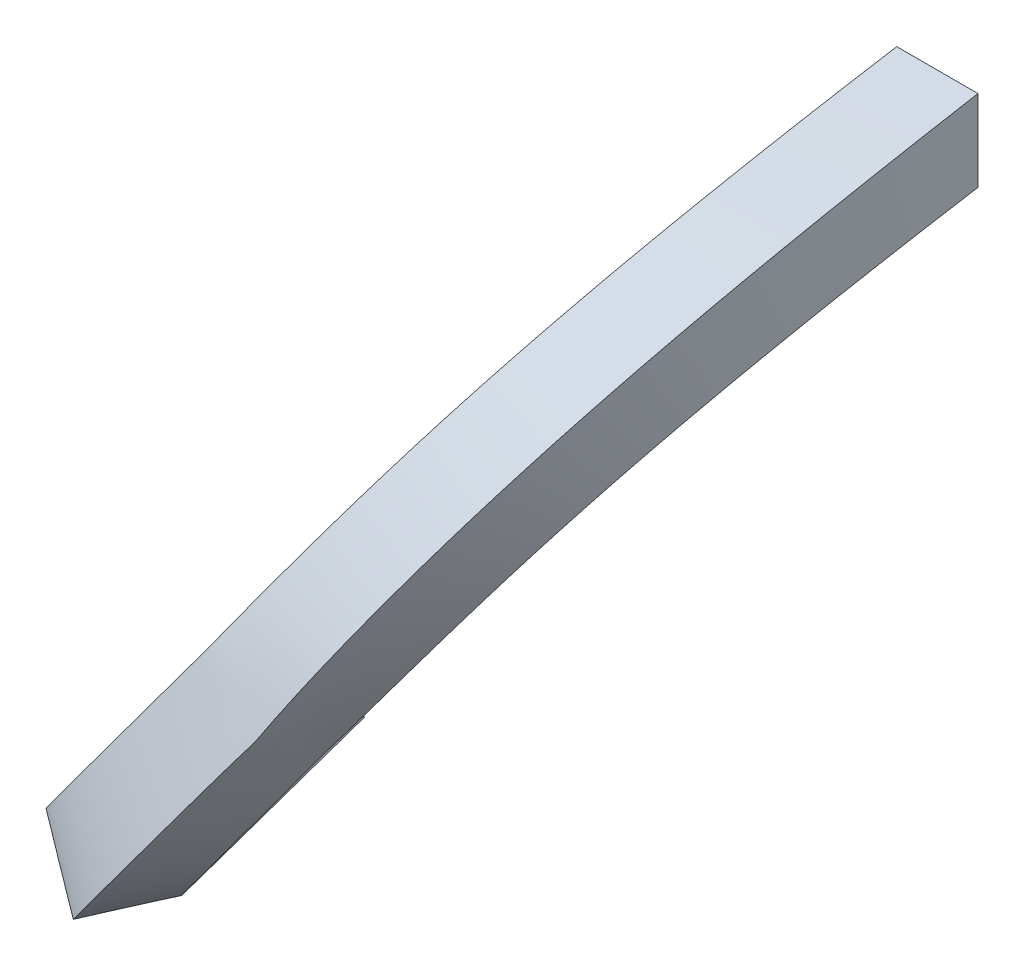
ISO-10303-21;
HEADER;
FILE_DESCRIPTION(('STEP AP214'),'2;1');
FILE_NAME('part.step','',(''),(''),'','','');
FILE_SCHEMA(('AUTOMOTIVE_DESIGN { 1 0 10303 214 1 1 1 1 }'));
ENDSEC;
DATA;
#1=APPLICATION_CONTEXT('core data for automotive mechanical design processes');
#2=APPLICATION_PROTOCOL_DEFINITION('international standard','automotive_design',2000,#1);
#3=PRODUCT_CONTEXT('',#1,'mechanical');
#4=PRODUCT('Part','Part','',(#3));
#5=PRODUCT_RELATED_PRODUCT_CATEGORY('part','',(#4));
#6=PRODUCT_DEFINITION_FORMATION('','',#4);
#7=PRODUCT_DEFINITION_CONTEXT('part definition',#1,'design');
#8=PRODUCT_DEFINITION('design','',#6,#7);
#9=PRODUCT_DEFINITION_SHAPE('','',#8);
#10=(LENGTH_UNIT() NAMED_UNIT(*) SI_UNIT(.MILLI.,.METRE.));
#11=(NAMED_UNIT(*) PLANE_ANGLE_UNIT() SI_UNIT($,.RADIAN.));
#12=(NAMED_UNIT(*) SI_UNIT($,.STERADIAN.) SOLID_ANGLE_UNIT());
#13=UNCERTAINTY_MEASURE_WITH_UNIT(LENGTH_MEASURE(1.E-05),#10,'distance_accuracy_value','');
#14=(GEOMETRIC_REPRESENTATION_CONTEXT(3) GLOBAL_UNCERTAINTY_ASSIGNED_CONTEXT((#13)) GLOBAL_UNIT_ASSIGNED_CONTEXT((#10,
#11,#12)) REPRESENTATION_CONTEXT('',''));
#15=CARTESIAN_POINT('',(0.,0.,0.));
#16=DIRECTION('',(0.,0.,1.));
#17=DIRECTION('',(1.,0.,0.));
#18=AXIS2_PLACEMENT_3D('',#15,#16,#17);
#19=CARTESIAN_POINT('',(-3.05311331771918E-13,-48.9988647583122,65.));
#20=DIRECTION('',(0.,0.,1.));
#21=DIRECTION('',(1.,0.,0.));
#22=AXIS2_PLACEMENT_3D('',#19,#20,#21);
#23=PLANE('',#22);
#24=DIRECTION('',(0.,-1.,0.));
#25=VECTOR('',#24,1.);
#26=CARTESIAN_POINT('',(6.,9.,65.));
#27=LINE('',#26,#25);
#28=CARTESIAN_POINT('',(6.,9.,65.));
#29=VERTEX_POINT('',#28);
#30=CARTESIAN_POINT('',(6.,3.,65.));
#31=VERTEX_POINT('',#30);
#32=EDGE_CURVE('E53',#29,#31,#27,.T.);
#33=ORIENTED_EDGE('',*,*,#32,.T.);
#34=DIRECTION('',(1.,0.,0.));
#35=VECTOR('',#34,1.);
#36=CARTESIAN_POINT('',(6.,3.,65.));
#37=LINE('',#36,#35);
#38=CARTESIAN_POINT('',(-3.05311331771918E-13,3.,65.));
#39=VERTEX_POINT('',#38);
#40=EDGE_CURVE('E86',#39,#31,#37,.T.);
#41=ORIENTED_EDGE('',*,*,#40,.F.);
#42=DIRECTION('',(0.,-1.,0.));
#43=VECTOR('',#42,1.);
#44=CARTESIAN_POINT('',(-3.05311331771918E-13,3.,65.));
#45=LINE('',#44,#43);
#46=CARTESIAN_POINT('',(-3.05311331771918E-13,9.,65.));
#47=VERTEX_POINT('',#46);
#48=EDGE_CURVE('E48',#47,#39,#45,.T.);
#49=ORIENTED_EDGE('',*,*,#48,.F.);
#50=DIRECTION('',(1.,0.,0.));
#51=VECTOR('',#50,1.);
#52=CARTESIAN_POINT('',(-3.05311331771918E-13,9.,65.));
#53=LINE('',#52,#51);
#54=EDGE_CURVE('E11',#47,#29,#53,.T.);
#55=ORIENTED_EDGE('',*,*,#54,.T.);
#56=EDGE_LOOP('',(#33,#41,#49,#55));
#57=FACE_BOUND('',#56,.T.);
#58=ADVANCED_FACE('F45',(#57),#23,.F.);
#59=CARTESIAN_POINT('',(6.,9.00000000000031,65.));
#60=CARTESIAN_POINT('',(5.40280756921834,7.18135018781605,71.4152975826379));
#61=CARTESIAN_POINT('',(4.67105958359944,5.2779814460596,76.690999262106));
#62=CARTESIAN_POINT('',(2.81543278618853,1.08245078364391,85.5265123660054));
#63=CARTESIAN_POINT('',(1.68368364310481,-1.22331117871008,89.0984078778213));
#64=CARTESIAN_POINT('',(-1.10671628689291,-6.4229908837077,94.8173151091131));
#65=CARTESIAN_POINT('',(-2.76472278512869,-9.30620777868841,96.9309077575619));
#66=CARTESIAN_POINT('',(-5.54626508941483,-13.9486680945471,99.2237914690663));
#67=CARTESIAN_POINT('',(-6.52180164412874,-15.5488491253596,99.8470876640336));
#68=CARTESIAN_POINT('',(-8.04208605173591,-18.0390497579983,100.622338468434));
#69=CARTESIAN_POINT('',(-8.55836320483751,-18.8843585592441,100.854162320835));
#70=CARTESIAN_POINT('',(-9.34328818241475,-20.1800962408668,101.166230399676));
#71=CARTESIAN_POINT('',(-9.60665916442101,-20.6166679412004,101.264282105701));
#72=CARTESIAN_POINT('',(-10.0034560628139,-21.2795478991145,101.402465293098));
#73=CARTESIAN_POINT('',(-10.1360081237371,-21.5018486640104,101.447039531196));
#74=CARTESIAN_POINT('',(-10.4014847709831,-21.9493614291828,101.533151083401));
#75=CARTESIAN_POINT('',(-10.5255867114283,-22.1818447244262,101.56874769266));
#76=CARTESIAN_POINT('',(-10.8992419649653,-22.7603130623049,101.689674315849));
#77=CARTESIAN_POINT('',(-11.1619898449163,-23.1016753429646,101.781880449951));
#78=CARTESIAN_POINT('',(-11.6639923003141,-23.8178847698099,101.941913044824));
#79=CARTESIAN_POINT('',(-11.9176398914388,-24.1808681167307,102.019428809285));
#80=CARTESIAN_POINT('',(-12.6870365107696,-25.2816807648881,102.242743732316));
#81=CARTESIAN_POINT('',(-13.211268308188,-26.0313061859608,102.37935865684));
#82=CARTESIAN_POINT('',(-14.8170680533625,-28.3110165065981,102.734203323045));
#83=CARTESIAN_POINT('',(-15.9314214318187,-29.8717288217575,102.898111222785));
#84=CARTESIAN_POINT('',(-19.3894680773729,-34.5753305682869,102.995562986707));
#85=CARTESIAN_POINT('',(-21.86635907328,-37.7723677316905,102.555178837191));
#86=CARTESIAN_POINT('',(-25.6806952062719,-42.0796766844984,100.110427460712));
#87=CARTESIAN_POINT('',(-26.9628963619509,-43.4232501437646,98.9886800481001));
#88=CARTESIAN_POINT('',(-29.4184428605526,-45.7157999988671,96.0339728884786));
#89=CARTESIAN_POINT('',(-30.5864045397536,-46.6591708911212,94.2057965952906));
#90=CARTESIAN_POINT('',(-33.7570697397786,-48.6887750929059,87.7137071265485));
#91=CARTESIAN_POINT('',(-35.4274102650952,-48.9888647583122,82.0801450275111));
#92=CARTESIAN_POINT('',(-36.6180059560611,-48.115135746131,74.929665336342));
#93=CARTESIAN_POINT('',(-3.05311331771918E-13,9.00000000000031,65.));
#94=CARTESIAN_POINT('',(-0.597288797004962,7.26897590676811,71.2882610686102));
#95=CARTESIAN_POINT('',(-1.3248807097128,5.45411927287544,76.3840995998434));
#96=CARTESIAN_POINT('',(-3.12252404198188,1.52304905245619,84.7371747901521));
#97=CARTESIAN_POINT('',(-4.19418405257936,-0.596135258377495,87.9978535784898));
#98=CARTESIAN_POINT('',(-6.77364044208268,-5.28192541466802,93.1626736787513));
#99=CARTESIAN_POINT('',(-8.28303418503752,-7.84757827172965,95.055593588104));
#100=CARTESIAN_POINT('',(-10.89071002628,-12.0729304347395,97.2382040133961));
#101=CARTESIAN_POINT('',(-11.8169393416692,-13.5438185331107,97.8575111998572));
#102=CARTESIAN_POINT('',(-13.2872201361527,-15.8546199963914,98.6933241067289));
#103=CARTESIAN_POINT('',(-13.7907752825936,-16.6423591005545,98.9565562517225));
#104=CARTESIAN_POINT('',(-14.5637197381505,-17.852839633878,99.3407516443575));
#105=CARTESIAN_POINT('',(-14.8242817971165,-18.2611571585806,99.4670783691841));
#106=CARTESIAN_POINT('',(-15.218779979032,-18.8814099527325,99.6560917928544));
#107=CARTESIAN_POINT('',(-15.3508847710637,-19.0894589252533,99.7190221737425));
#108=CARTESIAN_POINT('',(-15.616122200126,-19.5082760966372,99.845174316008));
#109=CARTESIAN_POINT('',(-15.7432886850536,-19.7205945637372,99.9201261923517));
#110=CARTESIAN_POINT('',(-16.1108409675513,-20.2756603889639,100.056866815772));
#111=CARTESIAN_POINT('',(-16.3602327586917,-20.6188840740636,100.104263744538));
#112=CARTESIAN_POINT('',(-16.8438989322142,-21.3165966499806,100.235306847643));
#113=CARTESIAN_POINT('',(-17.0879042100836,-21.6685562715538,100.299815516999));
#114=CARTESIAN_POINT('',(-17.8265013739622,-22.7316675557224,100.486330119039));
#115=CARTESIAN_POINT('',(-18.3277041840018,-23.4500372691622,100.601259105989));
#116=CARTESIAN_POINT('',(-19.8542639843157,-25.6186257174241,100.893632159061));
#117=CARTESIAN_POINT('',(-20.9024660860442,-27.0822391737989,101.018804577095));
#118=CARTESIAN_POINT('',(-24.0984097351265,-31.4106620421565,101.018680275878));
#119=CARTESIAN_POINT('',(-26.3007575634212,-34.2205131775668,100.525685571642));
#120=CARTESIAN_POINT('',(-29.5299939532942,-37.8251916543461,98.3266513551582));
#121=CARTESIAN_POINT('',(-30.5930030336701,-38.9227140327925,97.3474228897074));
#122=CARTESIAN_POINT('',(-32.6342093447298,-40.7934439488861,94.7867833957384));
#123=CARTESIAN_POINT('',(-33.6109470527847,-41.5649410040019,93.2061215662731));
#124=CARTESIAN_POINT('',(-36.3246882871437,-43.2359212212215,87.454356903984));
#125=CARTESIAN_POINT('',(-37.8432179396907,-43.4927894151608,82.2838073250657));
#126=CARTESIAN_POINT('',(-38.9479711758102,-42.6092345832884,75.4359404194458));
#127=B_SPLINE_SURFACE_WITH_KNOTS('',1,3,((#59,#60,#61,#62,#63,#64,#65,#66,#67,#68,#69,#70,#71,
#72,#73,#74,#75,#76,#77,#78,#79,#80,#81,#82,#83,#84,#85,#86,#87,#88,#89,#90,#91,#92),(#93,#94,
#95,#96,#97,#98,#99,#100,#101,#102,#103,#104,#105,#106,#107,#108,#109,#110,#111,#112,#113,#114,
#115,#116,#117,#118,#119,#120,#121,#122,#123,#124,#125,#126)),.UNSPECIFIED.,.F.,.F.,.F.,(2,2),
(4,2,2,2,2,2,2,2,2,2,2,2,2,2,2,2,4),(0.,1.),(0.,0.137553361324719,0.275106722649439,
0.412660083974158,0.481436764636518,0.515825104967698,0.533019275133288,0.541616360216083,
0.550213445298878,0.564269275133288,0.578325104967698,0.606436764636518,0.662660083974158,
0.775106722649439,0.831330041987079,0.887553361324719,1.),.UNSPECIFIED.);
#128=CARTESIAN_POINT('',(-3.05311331771918E-13,9.00000000000031,65.));
#129=CARTESIAN_POINT('',(-0.597288797004962,7.26897590676811,71.2882610686102));
#130=CARTESIAN_POINT('',(-1.3248807097128,5.45411927287544,76.3840995998434));
#131=CARTESIAN_POINT('',(-3.12252404198188,1.52304905245619,84.7371747901521));
#132=CARTESIAN_POINT('',(-4.19418405257936,-0.596135258377495,87.9978535784898));
#133=CARTESIAN_POINT('',(-6.77364044208268,-5.28192541466802,93.1626736787513));
#134=CARTESIAN_POINT('',(-8.28303418503752,-7.84757827172965,95.055593588104));
#135=CARTESIAN_POINT('',(-10.89071002628,-12.0729304347395,97.2382040133961));
#136=CARTESIAN_POINT('',(-11.8169393416692,-13.5438185331107,97.8575111998572));
#137=CARTESIAN_POINT('',(-13.2872201361527,-15.8546199963914,98.6933241067289));
#138=CARTESIAN_POINT('',(-13.7907752825936,-16.6423591005545,98.9565562517225));
#139=CARTESIAN_POINT('',(-14.5637197381505,-17.852839633878,99.3407516443575));
#140=CARTESIAN_POINT('',(-14.8242817971165,-18.2611571585806,99.4670783691841));
#141=CARTESIAN_POINT('',(-15.218779979032,-18.8814099527325,99.6560917928544));
#142=CARTESIAN_POINT('',(-15.3508847710637,-19.0894589252533,99.7190221737425));
#143=CARTESIAN_POINT('',(-15.616122200126,-19.5082760966372,99.845174316008));
#144=CARTESIAN_POINT('',(-15.7432886850536,-19.7205945637372,99.9201261923517));
#145=CARTESIAN_POINT('',(-16.1108409675513,-20.2756603889639,100.056866815772));
#146=CARTESIAN_POINT('',(-16.3602327586917,-20.6188840740636,100.104263744538));
#147=CARTESIAN_POINT('',(-16.8438989322142,-21.3165966499806,100.235306847643));
#148=CARTESIAN_POINT('',(-17.0879042100836,-21.6685562715538,100.299815516999));
#149=CARTESIAN_POINT('',(-17.8265013739622,-22.7316675557224,100.486330119039));
#150=CARTESIAN_POINT('',(-18.3277041840018,-23.4500372691622,100.601259105989));
#151=CARTESIAN_POINT('',(-19.8542639843157,-25.6186257174241,100.893632159061));
#152=CARTESIAN_POINT('',(-20.9024660860442,-27.0822391737989,101.018804577095));
#153=CARTESIAN_POINT('',(-24.0984097351265,-31.4106620421565,101.018680275878));
#154=CARTESIAN_POINT('',(-26.3007575634212,-34.2205131775668,100.525685571642));
#155=CARTESIAN_POINT('',(-29.5299939532942,-37.8251916543461,98.3266513551582));
#156=CARTESIAN_POINT('',(-30.5930030336701,-38.9227140327925,97.3474228897074));
#157=CARTESIAN_POINT('',(-32.6342093447298,-40.7934439488861,94.7867833957384));
#158=CARTESIAN_POINT('',(-33.6109470527847,-41.5649410040019,93.2061215662731));
#159=CARTESIAN_POINT('',(-36.3246882871437,-43.2359212212215,87.454356903984));
#160=CARTESIAN_POINT('',(-37.8432179396907,-43.4927894151608,82.2838073250657));
#161=CARTESIAN_POINT('',(-38.9479711758102,-42.6092345832884,75.4359404194458));
#162=B_SPLINE_CURVE_WITH_KNOTS('',3,(#128,#129,#130,#131,#132,#133,#134,#135,#136,#137,#138,
#139,#140,#141,#142,#143,#144,#145,#146,#147,#148,#149,#150,#151,#152,#153,#154,#155,#156,#157,
#158,#159,#160,#161),.UNSPECIFIED.,.F.,.F.,(4,2,2,2,2,2,2,2,2,2,2,2,2,2,2,2,4),(0.,
0.137553361324719,0.275106722649439,0.412660083974158,0.481436764636518,0.515825104967698,
0.533019275133288,0.541616360216083,0.550213445298878,0.564269275133288,0.578325104967698,
0.606436764636518,0.662660083974158,0.775106722649439,0.831330041987079,0.887553361324719,1.),.UNSPECIFIED.);
#163=CARTESIAN_POINT('',(-38.9479711758102,-42.6092345832884,75.4359404194458));
#164=VERTEX_POINT('',#163);
#165=EDGE_CURVE('E101',#47,#164,#162,.T.);
#166=DIRECTION('',(-0.388327536624833,0.91765019380705,0.0843791805173056));
#167=VECTOR('',#166,1.);
#168=CARTESIAN_POINT('',(-36.6180059560611,-48.115135746131,74.929665336342));
#169=LINE('',#168,#167);
#170=CARTESIAN_POINT('',(-36.6180059560611,-48.115135746131,74.929665336342));
#171=VERTEX_POINT('',#170);
#172=EDGE_CURVE('E109',#171,#164,#169,.T.);
#173=CARTESIAN_POINT('',(6.,9.00000000000031,65.));
#174=CARTESIAN_POINT('',(5.40280756921834,7.18135018781605,71.4152975826379));
#175=CARTESIAN_POINT('',(4.67105958359944,5.2779814460596,76.690999262106));
#176=CARTESIAN_POINT('',(2.81543278618853,1.08245078364391,85.5265123660054));
#177=CARTESIAN_POINT('',(1.68368364310481,-1.22331117871008,89.0984078778213));
#178=CARTESIAN_POINT('',(-1.10671628689291,-6.4229908837077,94.8173151091131));
#179=CARTESIAN_POINT('',(-2.76472278512869,-9.30620777868841,96.9309077575619));
#180=CARTESIAN_POINT('',(-5.54626508941483,-13.9486680945471,99.2237914690663));
#181=CARTESIAN_POINT('',(-6.52180164412874,-15.5488491253596,99.8470876640336));
#182=CARTESIAN_POINT('',(-8.04208605173591,-18.0390497579983,100.622338468434));
#183=CARTESIAN_POINT('',(-8.55836320483751,-18.8843585592441,100.854162320835));
#184=CARTESIAN_POINT('',(-9.34328818241475,-20.1800962408668,101.166230399676));
#185=CARTESIAN_POINT('',(-9.60665916442101,-20.6166679412004,101.264282105701));
#186=CARTESIAN_POINT('',(-10.0034560628139,-21.2795478991145,101.402465293098));
#187=CARTESIAN_POINT('',(-10.1360081237371,-21.5018486640104,101.447039531196));
#188=CARTESIAN_POINT('',(-10.4014847709831,-21.9493614291828,101.533151083401));
#189=CARTESIAN_POINT('',(-10.5255867114283,-22.1818447244262,101.56874769266));
#190=CARTESIAN_POINT('',(-10.8992419649653,-22.7603130623049,101.689674315849));
#191=CARTESIAN_POINT('',(-11.1619898449163,-23.1016753429646,101.781880449951));
#192=CARTESIAN_POINT('',(-11.6639923003141,-23.8178847698099,101.941913044824));
#193=CARTESIAN_POINT('',(-11.9176398914388,-24.1808681167307,102.019428809285));
#194=CARTESIAN_POINT('',(-12.6870365107696,-25.2816807648881,102.242743732316));
#195=CARTESIAN_POINT('',(-13.211268308188,-26.0313061859608,102.37935865684));
#196=CARTESIAN_POINT('',(-14.8170680533625,-28.3110165065981,102.734203323045));
#197=CARTESIAN_POINT('',(-15.9314214318187,-29.8717288217575,102.898111222785));
#198=CARTESIAN_POINT('',(-19.3894680773729,-34.5753305682869,102.995562986707));
#199=CARTESIAN_POINT('',(-21.86635907328,-37.7723677316905,102.555178837191));
#200=CARTESIAN_POINT('',(-25.6806952062719,-42.0796766844984,100.110427460712));
#201=CARTESIAN_POINT('',(-26.9628963619509,-43.4232501437646,98.9886800481001));
#202=CARTESIAN_POINT('',(-29.4184428605526,-45.7157999988671,96.0339728884786));
#203=CARTESIAN_POINT('',(-30.5864045397536,-46.6591708911212,94.2057965952906));
#204=CARTESIAN_POINT('',(-33.7570697397786,-48.6887750929059,87.7137071265485));
#205=CARTESIAN_POINT('',(-35.4274102650952,-48.9888647583122,82.0801450275111));
#206=CARTESIAN_POINT('',(-36.6180059560611,-48.115135746131,74.929665336342));
#207=B_SPLINE_CURVE_WITH_KNOTS('',3,(#173,#174,#175,#176,#177,#178,#179,#180,#181,#182,#183,
#184,#185,#186,#187,#188,#189,#190,#191,#192,#193,#194,#195,#196,#197,#198,#199,#200,#201,#202,
#203,#204,#205,#206),.UNSPECIFIED.,.F.,.F.,(4,2,2,2,2,2,2,2,2,2,2,2,2,2,2,2,4),(0.,
0.137553361324719,0.275106722649439,0.412660083974158,0.481436764636518,0.515825104967698,
0.533019275133288,0.541616360216083,0.550213445298878,0.564269275133288,0.578325104967698,
0.606436764636518,0.662660083974158,0.775106722649439,0.831330041987079,0.887553361324719,1.),.UNSPECIFIED.);
#208=EDGE_CURVE('E99',#29,#171,#207,.T.);
#209=ORIENTED_EDGE('',*,*,#165,.T.);
#210=ORIENTED_EDGE('',*,*,#172,.F.);
#211=ORIENTED_EDGE('',*,*,#208,.F.);
#212=ORIENTED_EDGE('',*,*,#54,.F.);
#213=EDGE_LOOP('',(#209,#210,#211,#212));
#214=FACE_BOUND('',#213,.T.);
#215=ADVANCED_FACE('F135',(#214),#127,.T.);
#216=CARTESIAN_POINT('',(6.,3.,65.));
#217=CARTESIAN_POINT('',(5.31477333908441,1.18100713894242,71.1602287564229));
#218=CARTESIAN_POINT('',(4.50533790417012,-0.708756516764681,76.0886308448194));
#219=CARTESIAN_POINT('',(2.56863162717579,-4.72992135064626,83.9815974242659));
#220=CARTESIAN_POINT('',(1.44296913251327,-6.85835459820756,86.9427355313732));
#221=CARTESIAN_POINT('',(-1.18378749204696,-11.4446041972786,91.4652946979329));
#222=CARTESIAN_POINT('',(-2.68328425660493,-13.9033735353279,93.0379371516034));
#223=CARTESIAN_POINT('',(-5.3110746296274,-17.9726115737477,94.7710944584493));
#224=CARTESIAN_POINT('',(-6.25035579396158,-19.392913026529,95.2432805440915));
#225=CARTESIAN_POINT('',(-7.77305513874158,-21.6303042962483,95.8221404786799));
#226=CARTESIAN_POINT('',(-8.29961244180737,-22.3938641704292,95.9933714348876));
#227=CARTESIAN_POINT('',(-9.12228799127195,-23.5659241036773,96.2174885387547));
#228=CARTESIAN_POINT('',(-9.40200782235253,-23.9610520675095,96.2867022861294));
#229=CARTESIAN_POINT('',(-9.83076689897332,-24.5602079931652,96.3816864836109));
#230=CARTESIAN_POINT('',(-9.97522026364858,-24.7610020083321,96.4118697948979));
#231=CARTESIAN_POINT('',(-10.2674142209761,-25.1646747225835,96.469096083362));
#232=CARTESIAN_POINT('',(-10.4211209657031,-25.3660031533998,96.4844089452681));
#233=CARTESIAN_POINT('',(-10.7993900990946,-25.9072816940091,96.5820947270593));
#234=CARTESIAN_POINT('',(-11.0185871013764,-26.2508218698424,96.6766898726684));
#235=CARTESIAN_POINT('',(-11.4826171572548,-26.9370433935879,96.8195491801763));
#236=CARTESIAN_POINT('',(-11.7177193160052,-27.2822540122097,96.8869508487694));
#237=CARTESIAN_POINT('',(-12.4305505624876,-28.322381919485,97.0763211457814));
#238=CARTESIAN_POINT('',(-12.9157748287848,-29.0218096328457,97.1855206106851));
#239=CARTESIAN_POINT('',(-14.391545756604,-31.1224785896752,97.448360403194));
#240=CARTESIAN_POINT('',(-15.4022968097651,-32.5261902453103,97.5370998797405));
#241=CARTESIAN_POINT('',(-18.4484113852391,-36.6148131114574,97.4079653831168));
#242=CARTESIAN_POINT('',(-20.4943673942176,-39.1697530150811,96.7867949352208));
#243=CARTESIAN_POINT('',(-23.3399873203743,-42.2488414643215,94.5633746605115));
#244=CARTESIAN_POINT('',(-24.252330440681,-43.1520047938357,93.6099171740866));
#245=CARTESIAN_POINT('',(-25.9912958894158,-44.6625796735811,91.1865795381048));
#246=CARTESIAN_POINT('',(-26.8193777427342,-45.2717017120348,89.7159501963863));
#247=CARTESIAN_POINT('',(-29.1572969900272,-46.5640887378814,84.333629055583));
#248=CARTESIAN_POINT('',(-30.5228562469533,-46.7115328589937,79.4411494760657));
#249=CARTESIAN_POINT('',(-31.5330373051082,-45.7655979568165,72.7796034778335));
#250=CARTESIAN_POINT('',(6.,9.00000000000031,65.));
#251=CARTESIAN_POINT('',(5.40280756921834,7.18135018781605,71.4152975826379));
#252=CARTESIAN_POINT('',(4.67105958359944,5.2779814460596,76.690999262106));
#253=CARTESIAN_POINT('',(2.81543278618853,1.08245078364391,85.5265123660054));
#254=CARTESIAN_POINT('',(1.68368364310481,-1.22331117871008,89.0984078778213));
#255=CARTESIAN_POINT('',(-1.10671628689291,-6.4229908837077,94.8173151091131));
#256=CARTESIAN_POINT('',(-2.76472278512869,-9.30620777868841,96.9309077575619));
#257=CARTESIAN_POINT('',(-5.54626508941483,-13.9486680945471,99.2237914690663));
#258=CARTESIAN_POINT('',(-6.52180164412874,-15.5488491253596,99.8470876640336));
#259=CARTESIAN_POINT('',(-8.04208605173591,-18.0390497579983,100.622338468434));
#260=CARTESIAN_POINT('',(-8.55836320483751,-18.8843585592441,100.854162320835));
#261=CARTESIAN_POINT('',(-9.34328818241475,-20.1800962408668,101.166230399676));
#262=CARTESIAN_POINT('',(-9.60665916442101,-20.6166679412004,101.264282105701));
#263=CARTESIAN_POINT('',(-10.0034560628139,-21.2795478991145,101.402465293098));
#264=CARTESIAN_POINT('',(-10.1360081237371,-21.5018486640104,101.447039531196));
#265=CARTESIAN_POINT('',(-10.4014847709831,-21.9493614291828,101.533151083401));
#266=CARTESIAN_POINT('',(-10.5255867114283,-22.1818447244262,101.56874769266));
#267=CARTESIAN_POINT('',(-10.8992419649653,-22.7603130623049,101.689674315849));
#268=CARTESIAN_POINT('',(-11.1619898449163,-23.1016753429646,101.781880449951));
#269=CARTESIAN_POINT('',(-11.6639923003141,-23.8178847698099,101.941913044824));
#270=CARTESIAN_POINT('',(-11.9176398914388,-24.1808681167307,102.019428809285));
#271=CARTESIAN_POINT('',(-12.6870365107696,-25.2816807648881,102.242743732316));
#272=CARTESIAN_POINT('',(-13.211268308188,-26.0313061859608,102.37935865684));
#273=CARTESIAN_POINT('',(-14.8170680533625,-28.3110165065981,102.734203323045));
#274=CARTESIAN_POINT('',(-15.9314214318187,-29.8717288217575,102.898111222785));
#275=CARTESIAN_POINT('',(-19.3894680773729,-34.5753305682869,102.995562986707));
#276=CARTESIAN_POINT('',(-21.86635907328,-37.7723677316905,102.555178837191));
#277=CARTESIAN_POINT('',(-25.6806952062719,-42.0796766844984,100.110427460712));
#278=CARTESIAN_POINT('',(-26.9628963619509,-43.4232501437646,98.9886800481001));
#279=CARTESIAN_POINT('',(-29.4184428605526,-45.7157999988671,96.0339728884786));
#280=CARTESIAN_POINT('',(-30.5864045397536,-46.6591708911212,94.2057965952906));
#281=CARTESIAN_POINT('',(-33.7570697397786,-48.6887750929059,87.7137071265485));
#282=CARTESIAN_POINT('',(-35.4274102650952,-48.9888647583122,82.0801450275111));
#283=CARTESIAN_POINT('',(-36.6180059560611,-48.115135746131,74.929665336342));
#284=B_SPLINE_SURFACE_WITH_KNOTS('',1,3,((#216,#217,#218,#219,#220,#221,#222,#223,#224,#225,
#226,#227,#228,#229,#230,#231,#232,#233,#234,#235,#236,#237,#238,#239,#240,#241,#242,#243,#244,
#245,#246,#247,#248,#249),(#250,#251,#252,#253,#254,#255,#256,#257,#258,#259,#260,#261,#262,
#263,#264,#265,#266,#267,#268,#269,#270,#271,#272,#273,#274,#275,#276,#277,#278,#279,#280,#281,
#282,#283)),.UNSPECIFIED.,.F.,.F.,.F.,(2,2),(4,2,2,2,2,2,2,2,2,2,2,2,2,2,2,2,4),(0.,1.),(0.,
0.137553361324719,0.275106722649439,0.412660083974158,0.481436764636518,0.515825104967698,
0.533019275133288,0.541616360216083,0.550213445298878,0.564269275133288,0.578325104967698,
0.606436764636518,0.662660083974158,0.775106722649439,0.831330041987079,0.887553361324719,1.),.UNSPECIFIED.);
#285=DIRECTION('',(-0.84749477515877,-0.391589631552407,0.358343643084729));
#286=VECTOR('',#285,1.);
#287=CARTESIAN_POINT('',(-31.5330373051082,-45.7655979568165,72.7796034778335));
#288=LINE('',#287,#286);
#289=CARTESIAN_POINT('',(-31.5330373051082,-45.7655979568165,72.7796034778335));
#290=VERTEX_POINT('',#289);
#291=EDGE_CURVE('E98',#290,#171,#288,.T.);
#292=CARTESIAN_POINT('',(6.,3.,65.));
#293=CARTESIAN_POINT('',(5.31477333908441,1.18100713894242,71.1602287564229));
#294=CARTESIAN_POINT('',(4.50533790417012,-0.708756516764681,76.0886308448194));
#295=CARTESIAN_POINT('',(2.56863162717579,-4.72992135064626,83.9815974242659));
#296=CARTESIAN_POINT('',(1.44296913251327,-6.85835459820756,86.9427355313732));
#297=CARTESIAN_POINT('',(-1.18378749204696,-11.4446041972786,91.4652946979329));
#298=CARTESIAN_POINT('',(-2.68328425660493,-13.9033735353279,93.0379371516034));
#299=CARTESIAN_POINT('',(-5.3110746296274,-17.9726115737477,94.7710944584493));
#300=CARTESIAN_POINT('',(-6.25035579396158,-19.392913026529,95.2432805440915));
#301=CARTESIAN_POINT('',(-7.77305513874158,-21.6303042962483,95.8221404786799));
#302=CARTESIAN_POINT('',(-8.29961244180737,-22.3938641704292,95.9933714348876));
#303=CARTESIAN_POINT('',(-9.12228799127195,-23.5659241036773,96.2174885387547));
#304=CARTESIAN_POINT('',(-9.40200782235253,-23.9610520675095,96.2867022861294));
#305=CARTESIAN_POINT('',(-9.83076689897332,-24.5602079931652,96.3816864836109));
#306=CARTESIAN_POINT('',(-9.97522026364858,-24.7610020083321,96.4118697948979));
#307=CARTESIAN_POINT('',(-10.2674142209761,-25.1646747225835,96.469096083362));
#308=CARTESIAN_POINT('',(-10.4211209657031,-25.3660031533998,96.4844089452681));
#309=CARTESIAN_POINT('',(-10.7993900990946,-25.9072816940091,96.5820947270593));
#310=CARTESIAN_POINT('',(-11.0185871013764,-26.2508218698424,96.6766898726684));
#311=CARTESIAN_POINT('',(-11.4826171572548,-26.9370433935879,96.8195491801763));
#312=CARTESIAN_POINT('',(-11.7177193160052,-27.2822540122097,96.8869508487694));
#313=CARTESIAN_POINT('',(-12.4305505624876,-28.322381919485,97.0763211457814));
#314=CARTESIAN_POINT('',(-12.9157748287848,-29.0218096328457,97.1855206106851));
#315=CARTESIAN_POINT('',(-14.391545756604,-31.1224785896752,97.448360403194));
#316=CARTESIAN_POINT('',(-15.4022968097651,-32.5261902453103,97.5370998797405));
#317=CARTESIAN_POINT('',(-18.4484113852391,-36.6148131114574,97.4079653831168));
#318=CARTESIAN_POINT('',(-20.4943673942176,-39.1697530150811,96.7867949352208));
#319=CARTESIAN_POINT('',(-23.3399873203743,-42.2488414643215,94.5633746605115));
#320=CARTESIAN_POINT('',(-24.252330440681,-43.1520047938357,93.6099171740866));
#321=CARTESIAN_POINT('',(-25.9912958894158,-44.6625796735811,91.1865795381048));
#322=CARTESIAN_POINT('',(-26.8193777427342,-45.2717017120348,89.7159501963863));
#323=CARTESIAN_POINT('',(-29.1572969900272,-46.5640887378814,84.333629055583));
#324=CARTESIAN_POINT('',(-30.5228562469533,-46.7115328589937,79.4411494760657));
#325=CARTESIAN_POINT('',(-31.5330373051082,-45.7655979568165,72.7796034778335));
#326=B_SPLINE_CURVE_WITH_KNOTS('',3,(#292,#293,#294,#295,#296,#297,#298,#299,#300,#301,#302,
#303,#304,#305,#306,#307,#308,#309,#310,#311,#312,#313,#314,#315,#316,#317,#318,#319,#320,#321,
#322,#323,#324,#325),.UNSPECIFIED.,.F.,.F.,(4,2,2,2,2,2,2,2,2,2,2,2,2,2,2,2,4),(0.,
0.137553361324719,0.275106722649439,0.412660083974158,0.481436764636518,0.515825104967698,
0.533019275133288,0.541616360216083,0.550213445298878,0.564269275133288,0.578325104967698,
0.606436764636518,0.662660083974158,0.775106722649439,0.831330041987079,0.887553361324719,1.),.UNSPECIFIED.);
#327=EDGE_CURVE('E90',#31,#290,#326,.T.);
#328=ORIENTED_EDGE('',*,*,#208,.T.);
#329=ORIENTED_EDGE('',*,*,#291,.F.);
#330=ORIENTED_EDGE('',*,*,#327,.F.);
#331=ORIENTED_EDGE('',*,*,#32,.F.);
#332=EDGE_LOOP('',(#328,#329,#330,#331));
#333=FACE_BOUND('',#332,.T.);
#334=ADVANCED_FACE('F97',(#333),#284,.T.);
#335=CARTESIAN_POINT('',(-3.05311331771918E-13,9.00000000000031,65.));
#336=CARTESIAN_POINT('',(-0.597288797004962,7.26897590676811,71.2882610686102));
#337=CARTESIAN_POINT('',(-1.3248807097128,5.45411927287544,76.3840995998434));
#338=CARTESIAN_POINT('',(-3.12252404198188,1.52304905245619,84.7371747901521));
#339=CARTESIAN_POINT('',(-4.19418405257936,-0.596135258377495,87.9978535784898));
#340=CARTESIAN_POINT('',(-6.77364044208268,-5.28192541466802,93.1626736787513));
#341=CARTESIAN_POINT('',(-8.28303418503752,-7.84757827172965,95.055593588104));
#342=CARTESIAN_POINT('',(-10.89071002628,-12.0729304347395,97.2382040133961));
#343=CARTESIAN_POINT('',(-11.8169393416692,-13.5438185331107,97.8575111998572));
#344=CARTESIAN_POINT('',(-13.2872201361527,-15.8546199963914,98.6933241067289));
#345=CARTESIAN_POINT('',(-13.7907752825936,-16.6423591005545,98.9565562517225));
#346=CARTESIAN_POINT('',(-14.5637197381505,-17.852839633878,99.3407516443575));
#347=CARTESIAN_POINT('',(-14.8242817971165,-18.2611571585806,99.4670783691841));
#348=CARTESIAN_POINT('',(-15.218779979032,-18.8814099527325,99.6560917928544));
#349=CARTESIAN_POINT('',(-15.3508847710637,-19.0894589252533,99.7190221737425));
#350=CARTESIAN_POINT('',(-15.616122200126,-19.5082760966372,99.845174316008));
#351=CARTESIAN_POINT('',(-15.7432886850536,-19.7205945637372,99.9201261923517));
#352=CARTESIAN_POINT('',(-16.1108409675513,-20.2756603889639,100.056866815772));
#353=CARTESIAN_POINT('',(-16.3602327586917,-20.6188840740636,100.104263744538));
#354=CARTESIAN_POINT('',(-16.8438989322142,-21.3165966499806,100.235306847643));
#355=CARTESIAN_POINT('',(-17.0879042100836,-21.6685562715538,100.299815516999));
#356=CARTESIAN_POINT('',(-17.8265013739622,-22.7316675557224,100.486330119039));
#357=CARTESIAN_POINT('',(-18.3277041840018,-23.4500372691622,100.601259105989));
#358=CARTESIAN_POINT('',(-19.8542639843157,-25.6186257174241,100.893632159061));
#359=CARTESIAN_POINT('',(-20.9024660860442,-27.0822391737989,101.018804577095));
#360=CARTESIAN_POINT('',(-24.0984097351265,-31.4106620421565,101.018680275878));
#361=CARTESIAN_POINT('',(-26.3007575634212,-34.2205131775668,100.525685571642));
#362=CARTESIAN_POINT('',(-29.5299939532942,-37.8251916543461,98.3266513551582));
#363=CARTESIAN_POINT('',(-30.5930030336701,-38.9227140327925,97.3474228897074));
#364=CARTESIAN_POINT('',(-32.6342093447298,-40.7934439488861,94.7867833957384));
#365=CARTESIAN_POINT('',(-33.6109470527847,-41.5649410040019,93.2061215662731));
#366=CARTESIAN_POINT('',(-36.3246882871437,-43.2359212212215,87.454356903984));
#367=CARTESIAN_POINT('',(-37.8432179396907,-43.4927894151608,82.2838073250657));
#368=CARTESIAN_POINT('',(-38.9479711758102,-42.6092345832884,75.4359404194458));
#369=CARTESIAN_POINT('',(-3.05311331771918E-13,3.,65.));
#370=CARTESIAN_POINT('',(-0.685342890784884,1.26863509298874,71.0331767332734));
#371=CARTESIAN_POINT('',(-1.49060238914212,-0.53261868994884,75.7817311825568));
#372=CARTESIAN_POINT('',(-3.36932520099463,-4.28932308183399,83.1922598484126));
#373=CARTESIAN_POINT('',(-4.43489856317402,-6.23117867787497,85.8421812319918));
#374=CARTESIAN_POINT('',(-6.85071164723361,-10.3035387282389,89.810653267621));
#375=CARTESIAN_POINT('',(-8.20159565650156,-12.4447440283813,91.1626229821455));
#376=CARTESIAN_POINT('',(-10.6555195664987,-16.096873913934,92.7855070027791));
#377=CARTESIAN_POINT('',(-11.5454934915021,-17.3878824342866,93.2537040799152));
#378=CARTESIAN_POINT('',(-13.0181892231584,-19.4458745346381,93.8931261169752));
#379=CARTESIAN_POINT('',(-13.53202451956,-20.1518647117397,94.0957653657886));
#380=CARTESIAN_POINT('',(-14.3427195470094,-21.2386674966886,94.3920097834296));
#381=CARTESIAN_POINT('',(-14.6196304550463,-21.6055412848879,94.4894985496164));
#382=CARTESIAN_POINT('',(-15.0460908151923,-22.162070046784,94.6353129833659));
#383=CARTESIAN_POINT('',(-15.1900969109752,-22.3486122695758,94.6838524374396));
#384=CARTESIAN_POINT('',(-15.482051650119,-22.7235893900371,94.7811193159745));
#385=CARTESIAN_POINT('',(-15.6388229393289,-22.9047529927108,94.8357874449618));
#386=CARTESIAN_POINT('',(-16.0109891016799,-23.4226290206681,94.9492872269794));
#387=CARTESIAN_POINT('',(-16.2168300151511,-23.76803060094,94.9990731672518));
#388=CARTESIAN_POINT('',(-16.6625237891556,-24.4357552737601,95.1129429829987));
#389=CARTESIAN_POINT('',(-16.8879836346492,-24.7699421670328,95.1673375564865));
#390=CARTESIAN_POINT('',(-17.5700154256817,-25.7723687103193,95.3199075324983));
#391=CARTESIAN_POINT('',(-18.0322107045971,-26.440540716044,95.4074210598337));
#392=CARTESIAN_POINT('',(-19.4287416875602,-28.4300878005073,95.6077892392098));
#393=CARTESIAN_POINT('',(-20.3733414639845,-29.7367005973518,95.6577932340509));
#394=CARTESIAN_POINT('',(-23.1573530430049,-33.450144585327,95.4310826722874));
#395=CARTESIAN_POINT('',(-24.9287658843472,-35.6178984609574,94.7573016696951));
#396=CARTESIAN_POINT('',(-27.1892860674025,-37.9943564341693,92.779598554946));
#397=CARTESIAN_POINT('',(-27.8824371124002,-38.6514686828636,91.9686600156939));
#398=CARTESIAN_POINT('',(-29.2070623735929,-39.7402236236001,89.9393900453646));
#399=CARTESIAN_POINT('',(-29.843920255758,-40.1774718249082,88.7162751673396));
#400=CARTESIAN_POINT('',(-31.7249155374069,-41.1112348662115,84.0742788330767));
#401=CARTESIAN_POINT('',(-32.9390011683986,-41.2158977211663,79.6447893674114));
#402=CARTESIAN_POINT('',(-33.8630025248573,-40.2596967939739,73.2858785609373));
#403=B_SPLINE_SURFACE_WITH_KNOTS('',1,3,((#335,#336,#337,#338,#339,#340,#341,#342,#343,#344,
#345,#346,#347,#348,#349,#350,#351,#352,#353,#354,#355,#356,#357,#358,#359,#360,#361,#362,#363,
#364,#365,#366,#367,#368),(#369,#370,#371,#372,#373,#374,#375,#376,#377,#378,#379,#380,#381,
#382,#383,#384,#385,#386,#387,#388,#389,#390,#391,#392,#393,#394,#395,#396,#397,#398,#399,#400,
#401,#402)),.UNSPECIFIED.,.F.,.F.,.F.,(2,2),(4,2,2,2,2,2,2,2,2,2,2,2,2,2,2,2,4),(0.,1.),(0.,
0.137553361324719,0.275106722649439,0.412660083974158,0.481436764636518,0.515825104967698,
0.533019275133288,0.541616360216083,0.550213445298878,0.564269275133288,0.578325104967698,
0.606436764636518,0.662660083974158,0.775106722649439,0.831330041987079,0.887553361324719,1.),.UNSPECIFIED.);
#404=CARTESIAN_POINT('',(-3.05311331771918E-13,3.,65.));
#405=CARTESIAN_POINT('',(-0.685342890784884,1.26863509298874,71.0331767332734));
#406=CARTESIAN_POINT('',(-1.49060238914212,-0.53261868994884,75.7817311825568));
#407=CARTESIAN_POINT('',(-3.36932520099463,-4.28932308183399,83.1922598484126));
#408=CARTESIAN_POINT('',(-4.43489856317402,-6.23117867787497,85.8421812319918));
#409=CARTESIAN_POINT('',(-6.85071164723361,-10.3035387282389,89.810653267621));
#410=CARTESIAN_POINT('',(-8.20159565650156,-12.4447440283813,91.1626229821455));
#411=CARTESIAN_POINT('',(-10.6555195664987,-16.096873913934,92.7855070027791));
#412=CARTESIAN_POINT('',(-11.5454934915021,-17.3878824342866,93.2537040799152));
#413=CARTESIAN_POINT('',(-13.0181892231584,-19.4458745346381,93.8931261169752));
#414=CARTESIAN_POINT('',(-13.53202451956,-20.1518647117397,94.0957653657886));
#415=CARTESIAN_POINT('',(-14.3427195470094,-21.2386674966886,94.3920097834296));
#416=CARTESIAN_POINT('',(-14.6196304550463,-21.6055412848879,94.4894985496164));
#417=CARTESIAN_POINT('',(-15.0460908151923,-22.162070046784,94.6353129833659));
#418=CARTESIAN_POINT('',(-15.1900969109752,-22.3486122695758,94.6838524374396));
#419=CARTESIAN_POINT('',(-15.482051650119,-22.7235893900371,94.7811193159745));
#420=CARTESIAN_POINT('',(-15.6388229393289,-22.9047529927108,94.8357874449618));
#421=CARTESIAN_POINT('',(-16.0109891016799,-23.4226290206681,94.9492872269794));
#422=CARTESIAN_POINT('',(-16.2168300151511,-23.76803060094,94.9990731672518));
#423=CARTESIAN_POINT('',(-16.6625237891556,-24.4357552737601,95.1129429829987));
#424=CARTESIAN_POINT('',(-16.8879836346492,-24.7699421670328,95.1673375564865));
#425=CARTESIAN_POINT('',(-17.5700154256817,-25.7723687103193,95.3199075324983));
#426=CARTESIAN_POINT('',(-18.0322107045971,-26.440540716044,95.4074210598337));
#427=CARTESIAN_POINT('',(-19.4287416875602,-28.4300878005073,95.6077892392098));
#428=CARTESIAN_POINT('',(-20.3733414639845,-29.7367005973518,95.6577932340509));
#429=CARTESIAN_POINT('',(-23.1573530430049,-33.450144585327,95.4310826722874));
#430=CARTESIAN_POINT('',(-24.9287658843472,-35.6178984609574,94.7573016696951));
#431=CARTESIAN_POINT('',(-27.1892860674025,-37.9943564341693,92.779598554946));
#432=CARTESIAN_POINT('',(-27.8824371124002,-38.6514686828636,91.9686600156939));
#433=CARTESIAN_POINT('',(-29.2070623735929,-39.7402236236001,89.9393900453646));
#434=CARTESIAN_POINT('',(-29.843920255758,-40.1774718249082,88.7162751673396));
#435=CARTESIAN_POINT('',(-31.7249155374069,-41.1112348662115,84.0742788330767));
#436=CARTESIAN_POINT('',(-32.9390011683986,-41.2158977211663,79.6447893674114));
#437=CARTESIAN_POINT('',(-33.8630025248573,-40.2596967939739,73.2858785609373));
#438=B_SPLINE_CURVE_WITH_KNOTS('',3,(#404,#405,#406,#407,#408,#409,#410,#411,#412,#413,#414,
#415,#416,#417,#418,#419,#420,#421,#422,#423,#424,#425,#426,#427,#428,#429,#430,#431,#432,#433,
#434,#435,#436,#437),.UNSPECIFIED.,.F.,.F.,(4,2,2,2,2,2,2,2,2,2,2,2,2,2,2,2,4),(0.,
0.137553361324719,0.275106722649439,0.412660083974158,0.481436764636518,0.515825104967698,
0.533019275133288,0.541616360216083,0.550213445298878,0.564269275133288,0.578325104967698,
0.606436764636518,0.662660083974158,0.775106722649439,0.831330041987079,0.887553361324719,1.),.UNSPECIFIED.);
#439=CARTESIAN_POINT('',(-33.8630025248573,-40.2596967939739,73.2858785609373));
#440=VERTEX_POINT('',#439);
#441=EDGE_CURVE('E92',#39,#440,#438,.T.);
#442=DIRECTION('',(0.84749477515877,0.391589631552407,-0.358343643084729));
#443=VECTOR('',#442,1.);
#444=CARTESIAN_POINT('',(-33.8630025248573,-40.2596967939739,73.2858785609373));
#445=LINE('',#444,#443);
#446=EDGE_CURVE('E114',#164,#440,#445,.T.);
#447=ORIENTED_EDGE('',*,*,#441,.T.);
#448=ORIENTED_EDGE('',*,*,#446,.F.);
#449=ORIENTED_EDGE('',*,*,#165,.F.);
#450=ORIENTED_EDGE('',*,*,#48,.T.);
#451=EDGE_LOOP('',(#447,#448,#449,#450));
#452=FACE_BOUND('',#451,.T.);
#453=ADVANCED_FACE('F132',(#452),#403,.T.);
#454=CARTESIAN_POINT('',(-31.3205181993809,-39.0849278993169,72.2108476316831));
#455=DIRECTION('',(-0.361876125735692,-0.0676437895636658,-0.92976878166348));
#456=DIRECTION('',(0.388327536624833,-0.91765019380705,-0.0843791805173056));
#457=AXIS2_PLACEMENT_3D('',#454,#455,#456);
#458=PLANE('',#457);
#459=ORIENTED_EDGE('',*,*,#291,.T.);
#460=ORIENTED_EDGE('',*,*,#172,.T.);
#461=ORIENTED_EDGE('',*,*,#446,.T.);
#462=DIRECTION('',(0.388327536624833,-0.91765019380705,-0.0843791805173056));
#463=VECTOR('',#462,1.);
#464=CARTESIAN_POINT('',(-31.5330373051082,-45.7655979568165,72.7796034778335));
#465=LINE('',#464,#463);
#466=EDGE_CURVE('E122',#440,#290,#465,.T.);
#467=ORIENTED_EDGE('',*,*,#466,.T.);
#468=EDGE_LOOP('',(#459,#460,#461,#467));
#469=FACE_BOUND('',#468,.T.);
#470=ADVANCED_FACE('F136',(#469),#458,.T.);
#471=CARTESIAN_POINT('',(-3.05311331771918E-13,3.,65.));
#472=CARTESIAN_POINT('',(-0.685342890784884,1.26863509298874,71.0331767332734));
#473=CARTESIAN_POINT('',(-1.49060238914212,-0.53261868994884,75.7817311825568));
#474=CARTESIAN_POINT('',(-3.36932520099463,-4.28932308183399,83.1922598484126));
#475=CARTESIAN_POINT('',(-4.43489856317402,-6.23117867787497,85.8421812319918));
#476=CARTESIAN_POINT('',(-6.85071164723361,-10.3035387282389,89.810653267621));
#477=CARTESIAN_POINT('',(-8.20159565650156,-12.4447440283813,91.1626229821455));
#478=CARTESIAN_POINT('',(-10.6555195664987,-16.096873913934,92.7855070027791));
#479=CARTESIAN_POINT('',(-11.5454934915021,-17.3878824342866,93.2537040799152));
#480=CARTESIAN_POINT('',(-13.0181892231584,-19.4458745346381,93.8931261169752));
#481=CARTESIAN_POINT('',(-13.53202451956,-20.1518647117397,94.0957653657886));
#482=CARTESIAN_POINT('',(-14.3427195470094,-21.2386674966886,94.3920097834296));
#483=CARTESIAN_POINT('',(-14.6196304550463,-21.6055412848879,94.4894985496164));
#484=CARTESIAN_POINT('',(-15.0460908151923,-22.162070046784,94.6353129833659));
#485=CARTESIAN_POINT('',(-15.1900969109752,-22.3486122695758,94.6838524374396));
#486=CARTESIAN_POINT('',(-15.482051650119,-22.7235893900371,94.7811193159745));
#487=CARTESIAN_POINT('',(-15.6388229393289,-22.9047529927108,94.8357874449618));
#488=CARTESIAN_POINT('',(-16.0109891016799,-23.4226290206681,94.9492872269794));
#489=CARTESIAN_POINT('',(-16.2168300151511,-23.76803060094,94.9990731672518));
#490=CARTESIAN_POINT('',(-16.6625237891556,-24.4357552737601,95.1129429829987));
#491=CARTESIAN_POINT('',(-16.8879836346492,-24.7699421670328,95.1673375564865));
#492=CARTESIAN_POINT('',(-17.5700154256817,-25.7723687103193,95.3199075324983));
#493=CARTESIAN_POINT('',(-18.0322107045971,-26.440540716044,95.4074210598337));
#494=CARTESIAN_POINT('',(-19.4287416875602,-28.4300878005073,95.6077892392098));
#495=CARTESIAN_POINT('',(-20.3733414639845,-29.7367005973518,95.6577932340509));
#496=CARTESIAN_POINT('',(-23.1573530430049,-33.450144585327,95.4310826722874));
#497=CARTESIAN_POINT('',(-24.9287658843472,-35.6178984609574,94.7573016696951));
#498=CARTESIAN_POINT('',(-27.1892860674025,-37.9943564341693,92.779598554946));
#499=CARTESIAN_POINT('',(-27.8824371124002,-38.6514686828636,91.9686600156939));
#500=CARTESIAN_POINT('',(-29.2070623735929,-39.7402236236001,89.9393900453646));
#501=CARTESIAN_POINT('',(-29.843920255758,-40.1774718249082,88.7162751673396));
#502=CARTESIAN_POINT('',(-31.7249155374069,-41.1112348662115,84.0742788330767));
#503=CARTESIAN_POINT('',(-32.9390011683986,-41.2158977211663,79.6447893674114));
#504=CARTESIAN_POINT('',(-33.8630025248573,-40.2596967939739,73.2858785609373));
#505=CARTESIAN_POINT('',(6.,3.,65.));
#506=CARTESIAN_POINT('',(5.31477333908441,1.18100713894242,71.1602287564229));
#507=CARTESIAN_POINT('',(4.50533790417012,-0.708756516764681,76.0886308448194));
#508=CARTESIAN_POINT('',(2.56863162717579,-4.72992135064626,83.9815974242659));
#509=CARTESIAN_POINT('',(1.44296913251327,-6.85835459820756,86.9427355313732));
#510=CARTESIAN_POINT('',(-1.18378749204696,-11.4446041972786,91.4652946979329));
#511=CARTESIAN_POINT('',(-2.68328425660493,-13.9033735353279,93.0379371516034));
#512=CARTESIAN_POINT('',(-5.3110746296274,-17.9726115737477,94.7710944584493));
#513=CARTESIAN_POINT('',(-6.25035579396158,-19.392913026529,95.2432805440915));
#514=CARTESIAN_POINT('',(-7.77305513874158,-21.6303042962483,95.8221404786799));
#515=CARTESIAN_POINT('',(-8.29961244180737,-22.3938641704292,95.9933714348876));
#516=CARTESIAN_POINT('',(-9.12228799127195,-23.5659241036773,96.2174885387547));
#517=CARTESIAN_POINT('',(-9.40200782235253,-23.9610520675095,96.2867022861294));
#518=CARTESIAN_POINT('',(-9.83076689897332,-24.5602079931652,96.3816864836109));
#519=CARTESIAN_POINT('',(-9.97522026364858,-24.7610020083321,96.4118697948979));
#520=CARTESIAN_POINT('',(-10.2674142209761,-25.1646747225835,96.469096083362));
#521=CARTESIAN_POINT('',(-10.4211209657031,-25.3660031533998,96.4844089452681));
#522=CARTESIAN_POINT('',(-10.7993900990946,-25.9072816940091,96.5820947270593));
#523=CARTESIAN_POINT('',(-11.0185871013764,-26.2508218698424,96.6766898726684));
#524=CARTESIAN_POINT('',(-11.4826171572548,-26.9370433935879,96.8195491801763));
#525=CARTESIAN_POINT('',(-11.7177193160052,-27.2822540122097,96.8869508487694));
#526=CARTESIAN_POINT('',(-12.4305505624876,-28.322381919485,97.0763211457814));
#527=CARTESIAN_POINT('',(-12.9157748287848,-29.0218096328457,97.1855206106851));
#528=CARTESIAN_POINT('',(-14.391545756604,-31.1224785896752,97.448360403194));
#529=CARTESIAN_POINT('',(-15.4022968097651,-32.5261902453103,97.5370998797405));
#530=CARTESIAN_POINT('',(-18.4484113852391,-36.6148131114574,97.4079653831168));
#531=CARTESIAN_POINT('',(-20.4943673942176,-39.1697530150811,96.7867949352208));
#532=CARTESIAN_POINT('',(-23.3399873203743,-42.2488414643215,94.5633746605115));
#533=CARTESIAN_POINT('',(-24.252330440681,-43.1520047938357,93.6099171740866));
#534=CARTESIAN_POINT('',(-25.9912958894158,-44.6625796735811,91.1865795381048));
#535=CARTESIAN_POINT('',(-26.8193777427342,-45.2717017120348,89.7159501963863));
#536=CARTESIAN_POINT('',(-29.1572969900272,-46.5640887378814,84.333629055583));
#537=CARTESIAN_POINT('',(-30.5228562469533,-46.7115328589937,79.4411494760657));
#538=CARTESIAN_POINT('',(-31.5330373051082,-45.7655979568165,72.7796034778335));
#539=B_SPLINE_SURFACE_WITH_KNOTS('',1,3,((#471,#472,#473,#474,#475,#476,#477,#478,#479,#480,
#481,#482,#483,#484,#485,#486,#487,#488,#489,#490,#491,#492,#493,#494,#495,#496,#497,#498,#499,
#500,#501,#502,#503,#504),(#505,#506,#507,#508,#509,#510,#511,#512,#513,#514,#515,#516,#517,
#518,#519,#520,#521,#522,#523,#524,#525,#526,#527,#528,#529,#530,#531,#532,#533,#534,#535,#536,
#537,#538)),.UNSPECIFIED.,.F.,.F.,.F.,(2,2),(4,2,2,2,2,2,2,2,2,2,2,2,2,2,2,2,4),(0.,1.),(0.,
0.137553361324719,0.275106722649439,0.412660083974158,0.481436764636518,0.515825104967698,
0.533019275133288,0.541616360216083,0.550213445298878,0.564269275133288,0.578325104967698,
0.606436764636518,0.662660083974158,0.775106722649439,0.831330041987079,0.887553361324719,1.),.UNSPECIFIED.);
#540=ORIENTED_EDGE('',*,*,#466,.F.);
#541=ORIENTED_EDGE('',*,*,#441,.F.);
#542=ORIENTED_EDGE('',*,*,#40,.T.);
#543=ORIENTED_EDGE('',*,*,#327,.T.);
#544=EDGE_LOOP('',(#540,#541,#542,#543));
#545=FACE_BOUND('',#544,.T.);
#546=ADVANCED_FACE('F88',(#545),#539,.T.);
#547=CLOSED_SHELL('',(#58,#215,#334,#453,#470,#546));
#548=MANIFOLD_SOLID_BREP('B2',#547);
#549=ADVANCED_BREP_SHAPE_REPRESENTATION('',(#18,#548),#14);
#550=SHAPE_DEFINITION_REPRESENTATION(#9,#549);
ENDSEC;
END-ISO-10303-21;
